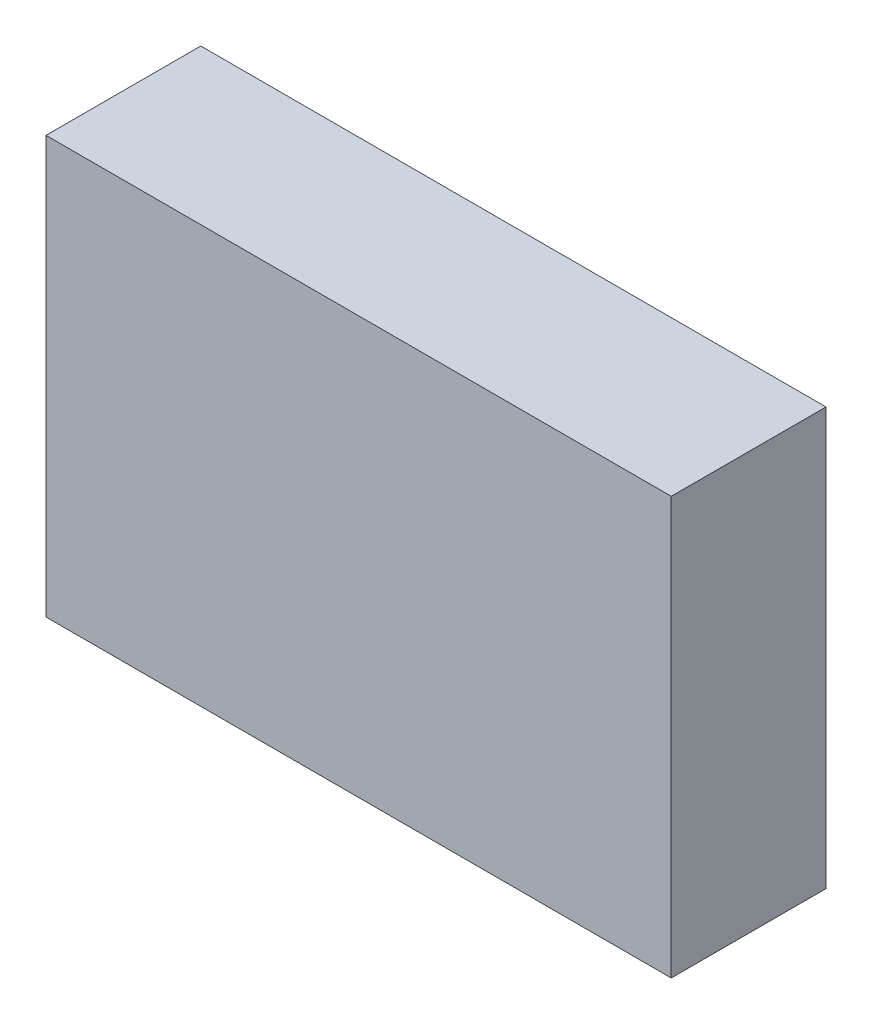
ISO-10303-21;
HEADER;
FILE_DESCRIPTION(('STEP AP214'),'2;1');
FILE_NAME('part.step','',(''),(''),'','','');
FILE_SCHEMA(('AUTOMOTIVE_DESIGN { 1 0 10303 214 1 1 1 1 }'));
ENDSEC;
DATA;
#1=APPLICATION_CONTEXT('core data for automotive mechanical design processes');
#2=APPLICATION_PROTOCOL_DEFINITION('international standard','automotive_design',2000,#1);
#3=PRODUCT_CONTEXT('',#1,'mechanical');
#4=PRODUCT('Part','Part','',(#3));
#5=PRODUCT_RELATED_PRODUCT_CATEGORY('part','',(#4));
#6=PRODUCT_DEFINITION_FORMATION('','',#4);
#7=PRODUCT_DEFINITION_CONTEXT('part definition',#1,'design');
#8=PRODUCT_DEFINITION('design','',#6,#7);
#9=PRODUCT_DEFINITION_SHAPE('','',#8);
#10=(LENGTH_UNIT() NAMED_UNIT(*) SI_UNIT(.MILLI.,.METRE.));
#11=(NAMED_UNIT(*) PLANE_ANGLE_UNIT() SI_UNIT($,.RADIAN.));
#12=(NAMED_UNIT(*) SI_UNIT($,.STERADIAN.) SOLID_ANGLE_UNIT());
#13=UNCERTAINTY_MEASURE_WITH_UNIT(LENGTH_MEASURE(1.E-05),#10,'distance_accuracy_value','');
#14=(GEOMETRIC_REPRESENTATION_CONTEXT(3) GLOBAL_UNCERTAINTY_ASSIGNED_CONTEXT((#13)) GLOBAL_UNIT_ASSIGNED_CONTEXT((#10,
#11,#12)) REPRESENTATION_CONTEXT('',''));
#15=CARTESIAN_POINT('',(0.,0.,0.));
#16=DIRECTION('',(0.,0.,1.));
#17=DIRECTION('',(1.,0.,0.));
#18=AXIS2_PLACEMENT_3D('',#15,#16,#17);
#19=CARTESIAN_POINT('',(2.9899991,1.99499982,1.48));
#20=DIRECTION('',(0.,0.,-1.));
#21=DIRECTION('',(-1.,0.,0.));
#22=AXIS2_PLACEMENT_3D('',#19,#20,#21);
#23=PLANE('',#22);
#24=DIRECTION('',(0.,1.,0.));
#25=VECTOR('',#24,1.);
#26=CARTESIAN_POINT('',(-2.9899991,1.99499982,1.48));
#27=LINE('',#26,#25);
#28=CARTESIAN_POINT('',(-2.9899991,1.99499982,1.48));
#29=VERTEX_POINT('',#28);
#30=CARTESIAN_POINT('',(-2.9899991,-1.99499982,1.48));
#31=VERTEX_POINT('',#30);
#32=EDGE_CURVE('E54',#29,#31,#27,.F.);
#33=ORIENTED_EDGE('',*,*,#32,.T.);
#34=DIRECTION('',(1.,0.,0.));
#35=VECTOR('',#34,1.);
#36=CARTESIAN_POINT('',(-2.9899991,-1.99499982,1.48));
#37=LINE('',#36,#35);
#38=CARTESIAN_POINT('',(2.9899991,-1.99499982,1.48));
#39=VERTEX_POINT('',#38);
#40=EDGE_CURVE('E56',#31,#39,#37,.T.);
#41=ORIENTED_EDGE('',*,*,#40,.T.);
#42=DIRECTION('',(0.,1.,0.));
#43=VECTOR('',#42,1.);
#44=CARTESIAN_POINT('',(2.9899991,-1.99499982,1.48));
#45=LINE('',#44,#43);
#46=CARTESIAN_POINT('',(2.9899991,1.99499982,1.48));
#47=VERTEX_POINT('',#46);
#48=EDGE_CURVE('E19',#39,#47,#45,.T.);
#49=ORIENTED_EDGE('',*,*,#48,.T.);
#50=DIRECTION('',(1.,0.,0.));
#51=VECTOR('',#50,1.);
#52=CARTESIAN_POINT('',(2.9899991,1.99499982,1.48));
#53=LINE('',#52,#51);
#54=EDGE_CURVE('E79',#47,#29,#53,.F.);
#55=ORIENTED_EDGE('',*,*,#54,.T.);
#56=EDGE_LOOP('',(#33,#41,#49,#55));
#57=FACE_BOUND('',#56,.T.);
#58=ADVANCED_FACE('F16',(#57),#23,.F.);
#59=CARTESIAN_POINT('',(2.9899991,-1.99499982,0.));
#60=DIRECTION('',(-1.,0.,0.));
#61=DIRECTION('',(0.,0.,1.));
#62=AXIS2_PLACEMENT_3D('',#59,#60,#61);
#63=PLANE('',#62);
#64=DIRECTION('',(0.,0.,-1.));
#65=VECTOR('',#64,1.);
#66=CARTESIAN_POINT('',(2.9899991,1.99499982,0.));
#67=LINE('',#66,#65);
#68=CARTESIAN_POINT('',(2.9899991,1.99499982,0.));
#69=VERTEX_POINT('',#68);
#70=EDGE_CURVE('E67',#69,#47,#67,.F.);
#71=ORIENTED_EDGE('',*,*,#70,.T.);
#72=ORIENTED_EDGE('',*,*,#48,.F.);
#73=DIRECTION('',(0.,0.,1.));
#74=VECTOR('',#73,1.);
#75=CARTESIAN_POINT('',(2.9899991,-1.99499982,0.));
#76=LINE('',#75,#74);
#77=CARTESIAN_POINT('',(2.9899991,-1.99499982,0.));
#78=VERTEX_POINT('',#77);
#79=EDGE_CURVE('E62',#39,#78,#76,.F.);
#80=ORIENTED_EDGE('',*,*,#79,.T.);
#81=DIRECTION('',(0.,1.,0.));
#82=VECTOR('',#81,1.);
#83=CARTESIAN_POINT('',(2.9899991,1.99499982,0.));
#84=LINE('',#83,#82);
#85=EDGE_CURVE('E82',#69,#78,#84,.F.);
#86=ORIENTED_EDGE('',*,*,#85,.F.);
#87=EDGE_LOOP('',(#71,#72,#80,#86));
#88=FACE_BOUND('',#87,.T.);
#89=ADVANCED_FACE('F64',(#88),#63,.F.);
#90=CARTESIAN_POINT('',(-2.9899991,-1.99499982,0.));
#91=DIRECTION('',(0.,1.,0.));
#92=DIRECTION('',(0.,0.,1.));
#93=AXIS2_PLACEMENT_3D('',#90,#91,#92);
#94=PLANE('',#93);
#95=ORIENTED_EDGE('',*,*,#79,.F.);
#96=ORIENTED_EDGE('',*,*,#40,.F.);
#97=DIRECTION('',(0.,0.,-1.));
#98=VECTOR('',#97,1.);
#99=CARTESIAN_POINT('',(-2.9899991,-1.99499982,0.));
#100=LINE('',#99,#98);
#101=CARTESIAN_POINT('',(-2.9899991,-1.99499982,0.));
#102=VERTEX_POINT('',#101);
#103=EDGE_CURVE('E74',#31,#102,#100,.T.);
#104=ORIENTED_EDGE('',*,*,#103,.T.);
#105=DIRECTION('',(-1.,0.,0.));
#106=VECTOR('',#105,1.);
#107=CARTESIAN_POINT('',(2.9899991,-1.99499982,0.));
#108=LINE('',#107,#106);
#109=EDGE_CURVE('E71',#78,#102,#108,.T.);
#110=ORIENTED_EDGE('',*,*,#109,.F.);
#111=EDGE_LOOP('',(#95,#96,#104,#110));
#112=FACE_BOUND('',#111,.T.);
#113=ADVANCED_FACE('F69',(#112),#94,.F.);
#114=CARTESIAN_POINT('',(-2.9899991,1.99499982,0.));
#115=DIRECTION('',(1.,0.,0.));
#116=DIRECTION('',(0.,0.,-1.));
#117=AXIS2_PLACEMENT_3D('',#114,#115,#116);
#118=PLANE('',#117);
#119=ORIENTED_EDGE('',*,*,#103,.F.);
#120=ORIENTED_EDGE('',*,*,#32,.F.);
#121=DIRECTION('',(0.,0.,-1.));
#122=VECTOR('',#121,1.);
#123=CARTESIAN_POINT('',(-2.9899991,1.99499982,0.));
#124=LINE('',#123,#122);
#125=CARTESIAN_POINT('',(-2.9899991,1.99499982,0.));
#126=VERTEX_POINT('',#125);
#127=EDGE_CURVE('E34',#29,#126,#124,.T.);
#128=ORIENTED_EDGE('',*,*,#127,.T.);
#129=DIRECTION('',(0.,1.,0.));
#130=VECTOR('',#129,1.);
#131=CARTESIAN_POINT('',(-2.9899991,1.99499982,0.));
#132=LINE('',#131,#130);
#133=EDGE_CURVE('E25',#102,#126,#132,.T.);
#134=ORIENTED_EDGE('',*,*,#133,.F.);
#135=EDGE_LOOP('',(#119,#120,#128,#134));
#136=FACE_BOUND('',#135,.T.);
#137=ADVANCED_FACE('F88',(#136),#118,.F.);
#138=CARTESIAN_POINT('',(2.9899991,1.99499982,0.));
#139=DIRECTION('',(0.,-1.,0.));
#140=DIRECTION('',(0.,0.,-1.));
#141=AXIS2_PLACEMENT_3D('',#138,#139,#140);
#142=PLANE('',#141);
#143=ORIENTED_EDGE('',*,*,#127,.F.);
#144=ORIENTED_EDGE('',*,*,#54,.F.);
#145=ORIENTED_EDGE('',*,*,#70,.F.);
#146=DIRECTION('',(-1.,0.,0.));
#147=VECTOR('',#146,1.);
#148=CARTESIAN_POINT('',(2.9899991,1.99499982,0.));
#149=LINE('',#148,#147);
#150=EDGE_CURVE('E11',#126,#69,#149,.F.);
#151=ORIENTED_EDGE('',*,*,#150,.F.);
#152=EDGE_LOOP('',(#143,#144,#145,#151));
#153=FACE_BOUND('',#152,.T.);
#154=ADVANCED_FACE('F90',(#153),#142,.F.);
#155=CARTESIAN_POINT('',(2.9899991,1.99499982,0.));
#156=DIRECTION('',(0.,0.,-1.));
#157=DIRECTION('',(-1.,0.,0.));
#158=AXIS2_PLACEMENT_3D('',#155,#156,#157);
#159=PLANE('',#158);
#160=ORIENTED_EDGE('',*,*,#133,.T.);
#161=ORIENTED_EDGE('',*,*,#150,.T.);
#162=ORIENTED_EDGE('',*,*,#85,.T.);
#163=ORIENTED_EDGE('',*,*,#109,.T.);
#164=EDGE_LOOP('',(#160,#161,#162,#163));
#165=FACE_BOUND('',#164,.T.);
#166=ADVANCED_FACE('F87',(#165),#159,.T.);
#167=CLOSED_SHELL('',(#58,#89,#113,#137,#154,#166));
#168=MANIFOLD_SOLID_BREP('B1',#167);
#169=ADVANCED_BREP_SHAPE_REPRESENTATION('',(#18,#168),#14);
#170=SHAPE_DEFINITION_REPRESENTATION(#9,#169);
ENDSEC;
END-ISO-10303-21;
